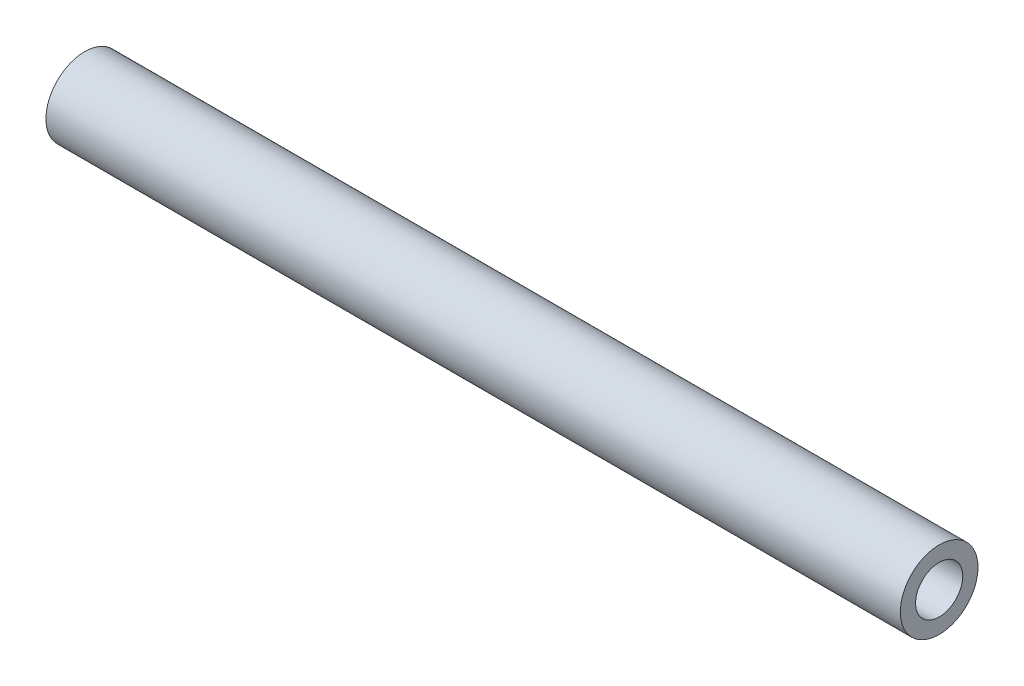
ISO-10303-21;
HEADER;
FILE_DESCRIPTION(('STEP AP214'),'2;1');
FILE_NAME('part.step','',(''),(''),'','','');
FILE_SCHEMA(('AUTOMOTIVE_DESIGN { 1 0 10303 214 1 1 1 1 }'));
ENDSEC;
DATA;
#1=APPLICATION_CONTEXT('core data for automotive mechanical design processes');
#2=APPLICATION_PROTOCOL_DEFINITION('international standard','automotive_design',2000,#1);
#3=PRODUCT_CONTEXT('',#1,'mechanical');
#4=PRODUCT('Part','Part','',(#3));
#5=PRODUCT_RELATED_PRODUCT_CATEGORY('part','',(#4));
#6=PRODUCT_DEFINITION_FORMATION('','',#4);
#7=PRODUCT_DEFINITION_CONTEXT('part definition',#1,'design');
#8=PRODUCT_DEFINITION('design','',#6,#7);
#9=PRODUCT_DEFINITION_SHAPE('','',#8);
#10=(LENGTH_UNIT() NAMED_UNIT(*) SI_UNIT(.MILLI.,.METRE.));
#11=(NAMED_UNIT(*) PLANE_ANGLE_UNIT() SI_UNIT($,.RADIAN.));
#12=(NAMED_UNIT(*) SI_UNIT($,.STERADIAN.) SOLID_ANGLE_UNIT());
#13=UNCERTAINTY_MEASURE_WITH_UNIT(LENGTH_MEASURE(1.E-05),#10,'distance_accuracy_value','');
#14=(GEOMETRIC_REPRESENTATION_CONTEXT(3) GLOBAL_UNCERTAINTY_ASSIGNED_CONTEXT((#13)) GLOBAL_UNIT_ASSIGNED_CONTEXT((#10,
#11,#12)) REPRESENTATION_CONTEXT('',''));
#15=CARTESIAN_POINT('',(0.,0.,0.));
#16=DIRECTION('',(0.,0.,1.));
#17=DIRECTION('',(1.,0.,0.));
#18=AXIS2_PLACEMENT_3D('',#15,#16,#17);
#19=CARTESIAN_POINT('',(34.925,0.,0.));
#20=DIRECTION('',(1.,0.,0.));
#21=DIRECTION('',(0.,0.,-1.));
#22=AXIS2_PLACEMENT_3D('',#19,#20,#21);
#23=PLANE('',#22);
#24=CARTESIAN_POINT('',(34.925,0.,0.));
#25=DIRECTION('',(1.,0.,0.));
#26=DIRECTION('',(0.,0.,-1.));
#27=AXIS2_PLACEMENT_3D('',#24,#25,#26);
#28=CIRCLE('',#27,3.175);
#29=CARTESIAN_POINT('',(34.925,0.,-3.175));
#30=VERTEX_POINT('',#29);
#31=EDGE_CURVE('E10',#30,#30,#28,.T.);
#32=ORIENTED_EDGE('',*,*,#31,.T.);
#33=EDGE_LOOP('',(#32));
#34=FACE_BOUND('',#33,.T.);
#35=CARTESIAN_POINT('',(34.925,0.,0.));
#36=DIRECTION('',(1.,0.,0.));
#37=DIRECTION('',(0.,0.,-1.));
#38=AXIS2_PLACEMENT_3D('',#35,#36,#37);
#39=CIRCLE('',#38,1.9304);
#40=CARTESIAN_POINT('',(34.925,0.,-1.9304));
#41=VERTEX_POINT('',#40);
#42=EDGE_CURVE('E50',#41,#41,#39,.T.);
#43=ORIENTED_EDGE('',*,*,#42,.F.);
#44=EDGE_LOOP('',(#43));
#45=FACE_BOUND('',#44,.T.);
#46=ADVANCED_FACE('F39',(#34,#45),#23,.T.);
#47=CARTESIAN_POINT('',(-34.925,0.,0.));
#48=DIRECTION('',(1.,0.,0.));
#49=DIRECTION('',(0.,0.,-1.));
#50=AXIS2_PLACEMENT_3D('',#47,#48,#49);
#51=PLANE('',#50);
#52=CARTESIAN_POINT('',(-34.925,0.,0.));
#53=DIRECTION('',(1.,0.,0.));
#54=DIRECTION('',(0.,0.,-1.));
#55=AXIS2_PLACEMENT_3D('',#52,#53,#54);
#56=CIRCLE('',#55,3.175);
#57=CARTESIAN_POINT('',(-34.925,0.,-3.175));
#58=VERTEX_POINT('',#57);
#59=EDGE_CURVE('E43',#58,#58,#56,.T.);
#60=ORIENTED_EDGE('',*,*,#59,.F.);
#61=EDGE_LOOP('',(#60));
#62=FACE_BOUND('',#61,.T.);
#63=CARTESIAN_POINT('',(-34.925,0.,0.));
#64=DIRECTION('',(1.,0.,0.));
#65=DIRECTION('',(0.,0.,-1.));
#66=AXIS2_PLACEMENT_3D('',#63,#64,#65);
#67=CIRCLE('',#66,1.9304);
#68=CARTESIAN_POINT('',(-34.925,0.,-1.9304));
#69=VERTEX_POINT('',#68);
#70=EDGE_CURVE('E52',#69,#69,#67,.T.);
#71=ORIENTED_EDGE('',*,*,#70,.T.);
#72=EDGE_LOOP('',(#71));
#73=FACE_BOUND('',#72,.T.);
#74=ADVANCED_FACE('F62',(#62,#73),#51,.F.);
#75=CARTESIAN_POINT('',(34.925,0.,0.));
#76=DIRECTION('',(-1.,0.,0.));
#77=DIRECTION('',(0.,0.,1.));
#78=AXIS2_PLACEMENT_3D('',#75,#76,#77);
#79=CYLINDRICAL_SURFACE('',#78,3.175);
#80=ORIENTED_EDGE('',*,*,#31,.F.);
#81=EDGE_LOOP('',(#80));
#82=FACE_BOUND('',#81,.T.);
#83=ORIENTED_EDGE('',*,*,#59,.T.);
#84=EDGE_LOOP('',(#83));
#85=FACE_BOUND('',#84,.T.);
#86=ADVANCED_FACE('F41',(#82,#85),#79,.T.);
#87=CARTESIAN_POINT('',(34.925,0.,0.));
#88=DIRECTION('',(-1.,0.,0.));
#89=DIRECTION('',(0.,0.,1.));
#90=AXIS2_PLACEMENT_3D('',#87,#88,#89);
#91=CYLINDRICAL_SURFACE('',#90,1.9304);
#92=ORIENTED_EDGE('',*,*,#42,.T.);
#93=EDGE_LOOP('',(#92));
#94=FACE_BOUND('',#93,.T.);
#95=ORIENTED_EDGE('',*,*,#70,.F.);
#96=EDGE_LOOP('',(#95));
#97=FACE_BOUND('',#96,.T.);
#98=ADVANCED_FACE('F58',(#94,#97),#91,.F.);
#99=CLOSED_SHELL('',(#46,#74,#86,#98));
#100=MANIFOLD_SOLID_BREP('B2',#99);
#101=ADVANCED_BREP_SHAPE_REPRESENTATION('',(#18,#100),#14);
#102=SHAPE_DEFINITION_REPRESENTATION(#9,#101);
ENDSEC;
END-ISO-10303-21;
